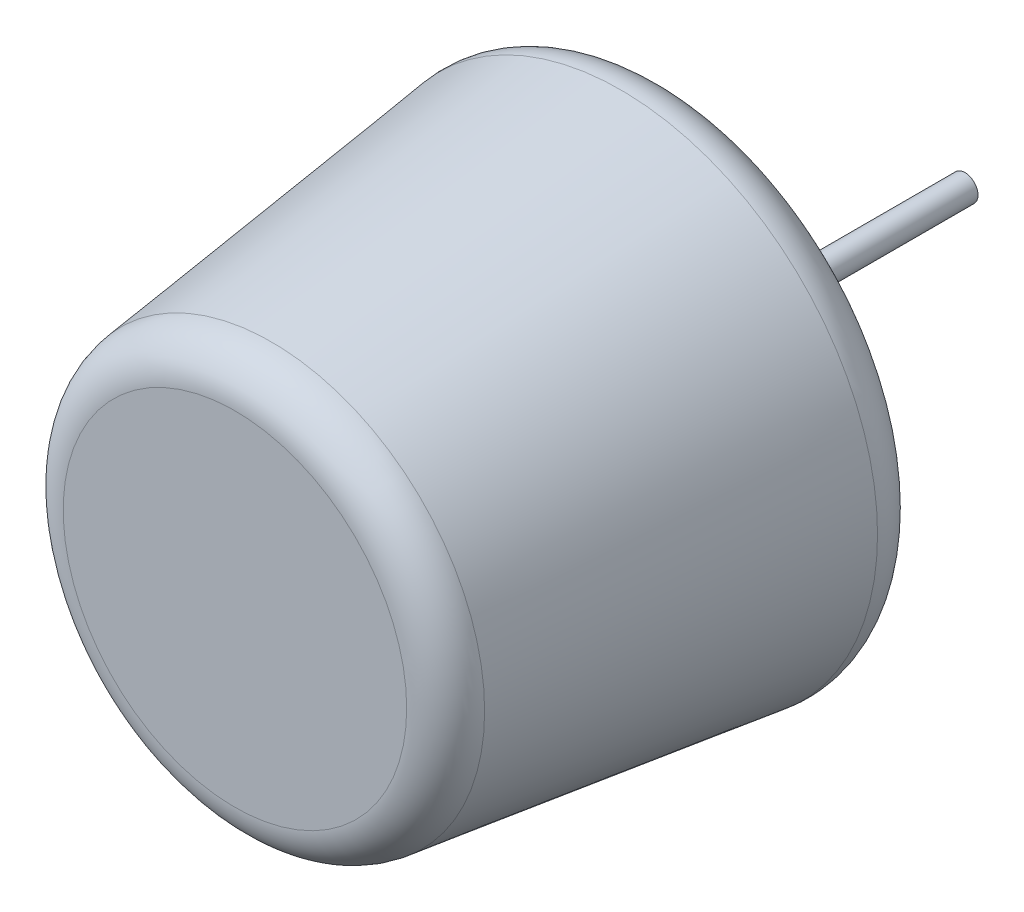
ISO-10303-21;
HEADER;
FILE_DESCRIPTION(('STEP AP214'),'2;1');
FILE_NAME('part.step','',(''),(''),'','','');
FILE_SCHEMA(('AUTOMOTIVE_DESIGN { 1 0 10303 214 1 1 1 1 }'));
ENDSEC;
DATA;
#1=APPLICATION_CONTEXT('core data for automotive mechanical design processes');
#2=APPLICATION_PROTOCOL_DEFINITION('international standard','automotive_design',2000,#1);
#3=PRODUCT_CONTEXT('',#1,'mechanical');
#4=PRODUCT('Part','Part','',(#3));
#5=PRODUCT_RELATED_PRODUCT_CATEGORY('part','',(#4));
#6=PRODUCT_DEFINITION_FORMATION('','',#4);
#7=PRODUCT_DEFINITION_CONTEXT('part definition',#1,'design');
#8=PRODUCT_DEFINITION('design','',#6,#7);
#9=PRODUCT_DEFINITION_SHAPE('','',#8);
#10=(LENGTH_UNIT() NAMED_UNIT(*) SI_UNIT(.MILLI.,.METRE.));
#11=(NAMED_UNIT(*) PLANE_ANGLE_UNIT() SI_UNIT($,.RADIAN.));
#12=(NAMED_UNIT(*) SI_UNIT($,.STERADIAN.) SOLID_ANGLE_UNIT());
#13=UNCERTAINTY_MEASURE_WITH_UNIT(LENGTH_MEASURE(1.E-05),#10,'distance_accuracy_value','');
#14=(GEOMETRIC_REPRESENTATION_CONTEXT(3) GLOBAL_UNCERTAINTY_ASSIGNED_CONTEXT((#13)) GLOBAL_UNIT_ASSIGNED_CONTEXT((#10,
#11,#12)) REPRESENTATION_CONTEXT('',''));
#15=CARTESIAN_POINT('',(0.,0.,0.));
#16=DIRECTION('',(0.,0.,1.));
#17=DIRECTION('',(1.,0.,0.));
#18=AXIS2_PLACEMENT_3D('',#15,#16,#17);
#19=CARTESIAN_POINT('',(0.,0.,0.));
#20=DIRECTION('',(0.,0.,1.));
#21=DIRECTION('',(1.,0.,0.));
#22=AXIS2_PLACEMENT_3D('',#19,#20,#21);
#23=PLANE('',#22);
#24=CARTESIAN_POINT('',(0.,0.,0.));
#25=DIRECTION('',(0.,0.,1.));
#26=DIRECTION('',(1.,0.,0.));
#27=AXIS2_PLACEMENT_3D('',#24,#25,#26);
#28=CIRCLE('',#27,10.4577331649152);
#29=CARTESIAN_POINT('',(10.4577331649152,0.,0.));
#30=VERTEX_POINT('',#29);
#31=EDGE_CURVE('E46',#30,#30,#28,.T.);
#32=ORIENTED_EDGE('',*,*,#31,.T.);
#33=EDGE_LOOP('',(#32));
#34=FACE_BOUND('',#33,.T.);
#35=ADVANCED_FACE('F31',(#34),#23,.T.);
#36=CARTESIAN_POINT('',(0.,0.,0.));
#37=DIRECTION('',(0.,0.,-1.));
#38=DIRECTION('',(-1.,0.,0.));
#39=AXIS2_PLACEMENT_3D('',#36,#37,#38);
#40=CONICAL_SURFACE('',#39,12.7,0.124354994546761);
#41=CARTESIAN_POINT('',(0.,0.,-2.22495177414342));
#42=DIRECTION('',(0.,0.,1.));
#43=DIRECTION('',(1.,0.,0.));
#44=AXIS2_PLACEMENT_3D('',#41,#42,#43);
#45=CIRCLE('',#44,12.9781189717679);
#46=CARTESIAN_POINT('',(12.9781189717679,0.,-2.22495177414342));
#47=VERTEX_POINT('',#46);
#48=EDGE_CURVE('E38',#47,#47,#45,.F.);
#49=ORIENTED_EDGE('',*,*,#48,.T.);
#50=EDGE_LOOP('',(#49));
#51=FACE_BOUND('',#50,.T.);
#52=CARTESIAN_POINT('',(0.,0.,-23.4906864359101));
#53=DIRECTION('',(0.,0.,1.));
#54=DIRECTION('',(1.,0.,0.));
#55=AXIS2_PLACEMENT_3D('',#52,#53,#54);
#56=CIRCLE('',#55,15.6363358044888);
#57=CARTESIAN_POINT('',(15.6363358044888,0.,-23.4906864359101));
#58=VERTEX_POINT('',#57);
#59=EDGE_CURVE('E42',#58,#58,#56,.T.);
#60=ORIENTED_EDGE('',*,*,#59,.T.);
#61=EDGE_LOOP('',(#60));
#62=FACE_BOUND('',#61,.T.);
#63=ADVANCED_FACE('F73',(#51,#62),#40,.T.);
#64=CARTESIAN_POINT('',(0.,0.,-25.4));
#65=DIRECTION('',(0.,0.,1.));
#66=DIRECTION('',(1.,0.,0.));
#67=AXIS2_PLACEMENT_3D('',#64,#65,#66);
#68=CONICAL_SURFACE('',#67,15.875,1.17227388112848);
#69=CARTESIAN_POINT('',(0.,0.,-26.1466885146174));
#70=DIRECTION('',(0.,0.,-1.));
#71=DIRECTION('',(-1.,0.,0.));
#72=AXIS2_PLACEMENT_3D('',#69,#70,#71);
#73=CIRCLE('',#72,14.1016147777837);
#74=CARTESIAN_POINT('',(-14.1016147777837,0.,-26.1466885146174));
#75=VERTEX_POINT('',#74);
#76=EDGE_CURVE('E10',#75,#75,#73,.T.);
#77=ORIENTED_EDGE('',*,*,#76,.T.);
#78=EDGE_LOOP('',(#77));
#79=FACE_BOUND('',#78,.T.);
#80=CARTESIAN_POINT('',(0.,0.,-31.75));
#81=DIRECTION('',(0.,0.,1.));
#82=DIRECTION('',(1.,0.,0.));
#83=AXIS2_PLACEMENT_3D('',#80,#81,#82);
#84=CIRCLE('',#83,0.79375);
#85=CARTESIAN_POINT('',(0.79375,0.,-31.75));
#86=VERTEX_POINT('',#85);
#87=EDGE_CURVE('E51',#86,#86,#84,.T.);
#88=ORIENTED_EDGE('',*,*,#87,.T.);
#89=EDGE_LOOP('',(#88));
#90=FACE_BOUND('',#89,.T.);
#91=ADVANCED_FACE('F70',(#79,#90),#68,.T.);
#92=CARTESIAN_POINT('',(0.,0.,0.));
#93=DIRECTION('',(0.,0.,1.));
#94=DIRECTION('',(1.,0.,0.));
#95=AXIS2_PLACEMENT_3D('',#92,#93,#94);
#96=CYLINDRICAL_SURFACE('',#95,0.79375);
#97=CARTESIAN_POINT('',(0.,0.,-44.45));
#98=DIRECTION('',(0.,0.,1.));
#99=DIRECTION('',(1.,0.,0.));
#100=AXIS2_PLACEMENT_3D('',#97,#98,#99);
#101=CIRCLE('',#100,0.79375);
#102=CARTESIAN_POINT('',(0.79375,0.,-44.45));
#103=VERTEX_POINT('',#102);
#104=EDGE_CURVE('E54',#103,#103,#101,.T.);
#105=ORIENTED_EDGE('',*,*,#104,.T.);
#106=EDGE_LOOP('',(#105));
#107=FACE_BOUND('',#106,.T.);
#108=ORIENTED_EDGE('',*,*,#87,.F.);
#109=EDGE_LOOP('',(#108));
#110=FACE_BOUND('',#109,.T.);
#111=ADVANCED_FACE('F58',(#107,#110),#96,.T.);
#112=CARTESIAN_POINT('',(0.79375,0.,-44.45));
#113=DIRECTION('',(0.,0.,-1.));
#114=DIRECTION('',(-1.,0.,0.));
#115=AXIS2_PLACEMENT_3D('',#112,#113,#114);
#116=PLANE('',#115);
#117=ORIENTED_EDGE('',*,*,#104,.F.);
#118=EDGE_LOOP('',(#117));
#119=FACE_BOUND('',#118,.T.);
#120=ADVANCED_FACE('F61',(#119),#116,.T.);
#121=CARTESIAN_POINT('',(0.,0.,-2.54));
#122=DIRECTION('',(0.,0.,1.));
#123=DIRECTION('',(1.,0.,0.));
#124=AXIS2_PLACEMENT_3D('',#121,#122,#123);
#125=TOROIDAL_SURFACE('',#124,10.4577331649152,2.54);
#126=ORIENTED_EDGE('',*,*,#48,.F.);
#127=EDGE_LOOP('',(#126));
#128=FACE_BOUND('',#127,.T.);
#129=ORIENTED_EDGE('',*,*,#31,.F.);
#130=EDGE_LOOP('',(#129));
#131=FACE_BOUND('',#130,.T.);
#132=ADVANCED_FACE('F63',(#128,#131),#125,.T.);
#133=CARTESIAN_POINT('',(0.,0.,-23.8057346617667));
#134=DIRECTION('',(0.,0.,-1.));
#135=DIRECTION('',(-1.,0.,0.));
#136=AXIS2_PLACEMENT_3D('',#133,#134,#135);
#137=TOROIDAL_SURFACE('',#136,13.115949997636,2.54);
#138=ORIENTED_EDGE('',*,*,#76,.F.);
#139=EDGE_LOOP('',(#138));
#140=FACE_BOUND('',#139,.T.);
#141=ORIENTED_EDGE('',*,*,#59,.F.);
#142=EDGE_LOOP('',(#141));
#143=FACE_BOUND('',#142,.T.);
#144=ADVANCED_FACE('F33',(#140,#143),#137,.T.);
#145=CLOSED_SHELL('',(#35,#63,#91,#111,#120,#132,#144));
#146=MANIFOLD_SOLID_BREP('B2',#145);
#147=ADVANCED_BREP_SHAPE_REPRESENTATION('',(#18,#146),#14);
#148=SHAPE_DEFINITION_REPRESENTATION(#9,#147);
ENDSEC;
END-ISO-10303-21;
